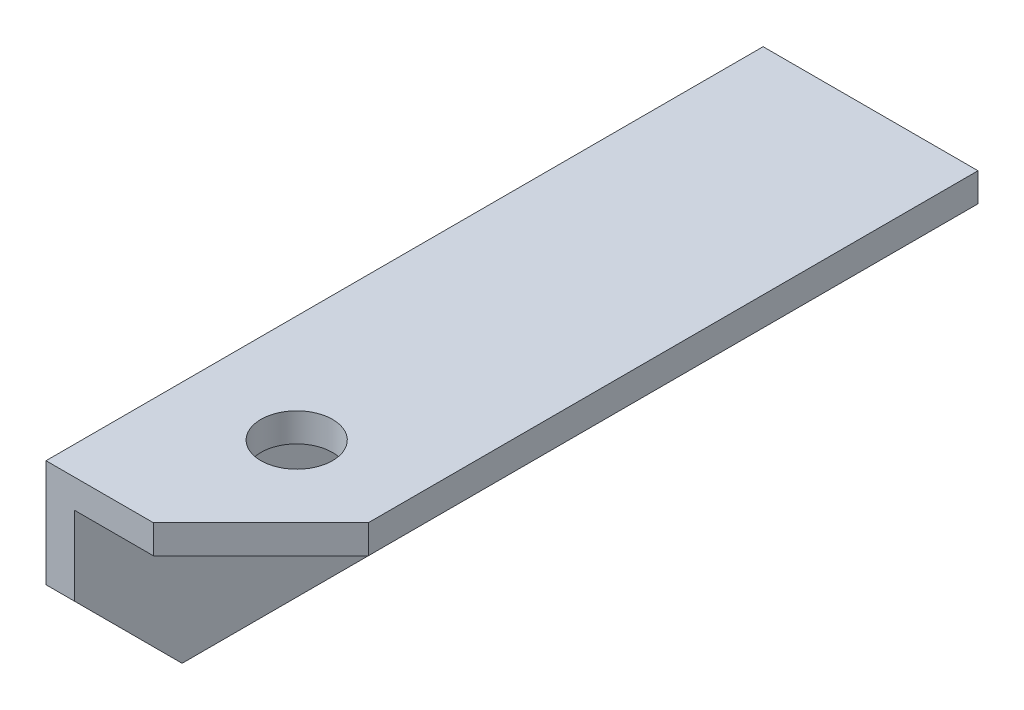
ISO-10303-21;
HEADER;
FILE_DESCRIPTION(('STEP AP214'),'2;1');
FILE_NAME('part.step','',(''),(''),'','','');
FILE_SCHEMA(('AUTOMOTIVE_DESIGN { 1 0 10303 214 1 1 1 1 }'));
ENDSEC;
DATA;
#1=APPLICATION_CONTEXT('core data for automotive mechanical design processes');
#2=APPLICATION_PROTOCOL_DEFINITION('international standard','automotive_design',2000,#1);
#3=PRODUCT_CONTEXT('',#1,'mechanical');
#4=PRODUCT('Part','Part','',(#3));
#5=PRODUCT_RELATED_PRODUCT_CATEGORY('part','',(#4));
#6=PRODUCT_DEFINITION_FORMATION('','',#4);
#7=PRODUCT_DEFINITION_CONTEXT('part definition',#1,'design');
#8=PRODUCT_DEFINITION('design','',#6,#7);
#9=PRODUCT_DEFINITION_SHAPE('','',#8);
#10=(LENGTH_UNIT() NAMED_UNIT(*) SI_UNIT(.MILLI.,.METRE.));
#11=(NAMED_UNIT(*) PLANE_ANGLE_UNIT() SI_UNIT($,.RADIAN.));
#12=(NAMED_UNIT(*) SI_UNIT($,.STERADIAN.) SOLID_ANGLE_UNIT());
#13=UNCERTAINTY_MEASURE_WITH_UNIT(LENGTH_MEASURE(1.E-05),#10,'distance_accuracy_value','');
#14=(GEOMETRIC_REPRESENTATION_CONTEXT(3) GLOBAL_UNCERTAINTY_ASSIGNED_CONTEXT((#13)) GLOBAL_UNIT_ASSIGNED_CONTEXT((#10,
#11,#12)) REPRESENTATION_CONTEXT('',''));
#15=CARTESIAN_POINT('',(0.,0.,0.));
#16=DIRECTION('',(0.,0.,1.));
#17=DIRECTION('',(1.,0.,0.));
#18=AXIS2_PLACEMENT_3D('',#15,#16,#17);
#19=CARTESIAN_POINT('',(1.75,647.65,-11.0990731963808));
#20=DIRECTION('',(0.,-1.,0.));
#21=DIRECTION('',(1.,0.,0.));
#22=AXIS2_PLACEMENT_3D('',#19,#20,#21);
#23=PLANE('',#22);
#24=CARTESIAN_POINT('',(44.9999999999998,647.65,-1.01671635384947E-13));
#25=DIRECTION('',(0.,-1.,0.));
#26=DIRECTION('',(0.,0.,-1.));
#27=AXIS2_PLACEMENT_3D('',#24,#25,#26);
#28=CIRCLE('',#27,4.99999999999999);
#29=CARTESIAN_POINT('',(44.9999999999998,647.65,-5.00000000000009));
#30=VERTEX_POINT('',#29);
#31=EDGE_CURVE('E218',#30,#30,#28,.T.);
#32=ORIENTED_EDGE('',*,*,#31,.T.);
#33=EDGE_LOOP('',(#32));
#34=FACE_BOUND('',#33,.T.);
#35=DIRECTION('',(-0.707106781186548,0.,0.707106781186547));
#36=VECTOR('',#35,1.);
#37=CARTESIAN_POINT('',(59.9999999999998,647.65,4.9999999999999));
#38=LINE('',#37,#36);
#39=CARTESIAN_POINT('',(59.9999999999998,647.65,4.99999999999991));
#40=VERTEX_POINT('',#39);
#41=CARTESIAN_POINT('',(44.9999999999998,647.65,19.9999999999999));
#42=VERTEX_POINT('',#41);
#43=EDGE_CURVE('E12',#40,#42,#38,.T.);
#44=ORIENTED_EDGE('',*,*,#43,.F.);
#45=DIRECTION('',(0.,0.,1.));
#46=VECTOR('',#45,1.);
#47=CARTESIAN_POINT('',(59.9999999999998,647.65,-80.1201360343224));
#48=LINE('',#47,#46);
#49=CARTESIAN_POINT('',(59.9999999999998,647.65,-80.1201360343224));
#50=VERTEX_POINT('',#49);
#51=EDGE_CURVE('E152',#50,#40,#48,.T.);
#52=ORIENTED_EDGE('',*,*,#51,.F.);
#53=DIRECTION('',(1.,0.,0.));
#54=VECTOR('',#53,1.);
#55=CARTESIAN_POINT('',(59.9999999999998,647.65,-80.1201360343224));
#56=LINE('',#55,#54);
#57=CARTESIAN_POINT('',(29.9999999999998,647.65,-80.1201360343224));
#58=VERTEX_POINT('',#57);
#59=EDGE_CURVE('E143',#58,#50,#56,.T.);
#60=ORIENTED_EDGE('',*,*,#59,.F.);
#61=DIRECTION('',(0.,0.,-1.));
#62=VECTOR('',#61,1.);
#63=CARTESIAN_POINT('',(29.9999999999998,647.65,-80.1201360343224));
#64=LINE('',#63,#62);
#65=CARTESIAN_POINT('',(29.9999999999998,647.65,19.9999999999999));
#66=VERTEX_POINT('',#65);
#67=EDGE_CURVE('E213',#66,#58,#64,.T.);
#68=ORIENTED_EDGE('',*,*,#67,.F.);
#69=DIRECTION('',(1.,0.,0.));
#70=VECTOR('',#69,1.);
#71=CARTESIAN_POINT('',(33.9999999999998,647.65,19.9999999999999));
#72=LINE('',#71,#70);
#73=EDGE_CURVE('E132',#66,#42,#72,.T.);
#74=ORIENTED_EDGE('',*,*,#73,.T.);
#75=EDGE_LOOP('',(#44,#52,#60,#68,#74));
#76=FACE_BOUND('',#75,.T.);
#77=ADVANCED_FACE('F38',(#34,#76),#23,.F.);
#78=CARTESIAN_POINT('',(1.75,643.65,-11.0990731963808));
#79=DIRECTION('',(0.,-1.,0.));
#80=DIRECTION('',(1.,0.,0.));
#81=AXIS2_PLACEMENT_3D('',#78,#79,#80);
#82=PLANE('',#81);
#83=CARTESIAN_POINT('',(44.9999999999998,643.65,-1.01671635384947E-13));
#84=DIRECTION('',(0.,-1.,0.));
#85=DIRECTION('',(0.,0.,-1.));
#86=AXIS2_PLACEMENT_3D('',#83,#84,#85);
#87=CIRCLE('',#86,4.99999999999999);
#88=CARTESIAN_POINT('',(44.9999999999998,643.65,-5.00000000000009));
#89=VERTEX_POINT('',#88);
#90=EDGE_CURVE('E222',#89,#89,#87,.T.);
#91=ORIENTED_EDGE('',*,*,#90,.F.);
#92=EDGE_LOOP('',(#91));
#93=FACE_BOUND('',#92,.T.);
#94=DIRECTION('',(-0.707106781186548,0.,0.707106781186547));
#95=VECTOR('',#94,1.);
#96=CARTESIAN_POINT('',(59.9999999999998,643.65,4.9999999999999));
#97=LINE('',#96,#95);
#98=CARTESIAN_POINT('',(59.9999999999998,643.65,4.99999999999991));
#99=VERTEX_POINT('',#98);
#100=CARTESIAN_POINT('',(44.9999999999998,643.65,19.9999999999999));
#101=VERTEX_POINT('',#100);
#102=EDGE_CURVE('E179',#99,#101,#97,.T.);
#103=ORIENTED_EDGE('',*,*,#102,.T.);
#104=DIRECTION('',(1.,0.,0.));
#105=VECTOR('',#104,1.);
#106=CARTESIAN_POINT('',(33.9999999999998,643.65,19.9999999999999));
#107=LINE('',#106,#105);
#108=CARTESIAN_POINT('',(33.9999999999998,643.65,19.9999999999999));
#109=VERTEX_POINT('',#108);
#110=EDGE_CURVE('E140',#109,#101,#107,.T.);
#111=ORIENTED_EDGE('',*,*,#110,.F.);
#112=DIRECTION('',(0.,0.,1.));
#113=VECTOR('',#112,1.);
#114=CARTESIAN_POINT('',(33.9999999999998,643.65,19.9999999999999));
#115=LINE('',#114,#113);
#116=CARTESIAN_POINT('',(33.9999999999998,643.65,-80.1201360343224));
#117=VERTEX_POINT('',#116);
#118=EDGE_CURVE('E129',#117,#109,#115,.T.);
#119=ORIENTED_EDGE('',*,*,#118,.F.);
#120=DIRECTION('',(-1.,0.,0.));
#121=VECTOR('',#120,1.);
#122=CARTESIAN_POINT('',(44.9999999999998,643.65,-80.1201360343224));
#123=LINE('',#122,#121);
#124=CARTESIAN_POINT('',(59.9999999999998,643.65,-80.1201360343224));
#125=VERTEX_POINT('',#124);
#126=EDGE_CURVE('E147',#125,#117,#123,.T.);
#127=ORIENTED_EDGE('',*,*,#126,.F.);
#128=DIRECTION('',(0.,0.,1.));
#129=VECTOR('',#128,1.);
#130=CARTESIAN_POINT('',(59.9999999999998,643.65,-80.1201360343224));
#131=LINE('',#130,#129);
#132=EDGE_CURVE('E149',#125,#99,#131,.T.);
#133=ORIENTED_EDGE('',*,*,#132,.T.);
#134=EDGE_LOOP('',(#103,#111,#119,#127,#133));
#135=FACE_BOUND('',#134,.T.);
#136=ADVANCED_FACE('F195',(#93,#135),#82,.T.);
#137=CARTESIAN_POINT('',(52.4999999999998,647.65,12.4999999999999));
#138=DIRECTION('',(0.707106781186547,0.,0.707106781186548));
#139=DIRECTION('',(0.707106781186548,0.,-0.707106781186547));
#140=AXIS2_PLACEMENT_3D('',#137,#138,#139);
#141=PLANE('',#140);
#142=ORIENTED_EDGE('',*,*,#43,.T.);
#143=DIRECTION('',(0.,-1.,0.));
#144=VECTOR('',#143,1.);
#145=CARTESIAN_POINT('',(44.9999999999998,647.65,19.9999999999999));
#146=LINE('',#145,#144);
#147=EDGE_CURVE('E48',#101,#42,#146,.F.);
#148=ORIENTED_EDGE('',*,*,#147,.F.);
#149=ORIENTED_EDGE('',*,*,#102,.F.);
#150=DIRECTION('',(0.,1.,0.));
#151=VECTOR('',#150,1.);
#152=CARTESIAN_POINT('',(59.9999999999998,647.65,4.9999999999999));
#153=LINE('',#152,#151);
#154=EDGE_CURVE('E42',#40,#99,#153,.F.);
#155=ORIENTED_EDGE('',*,*,#154,.F.);
#156=EDGE_LOOP('',(#142,#148,#149,#155));
#157=FACE_BOUND('',#156,.T.);
#158=ADVANCED_FACE('F40',(#157),#141,.T.);
#159=CARTESIAN_POINT('',(59.9999999999998,643.65,-80.1201360343224));
#160=DIRECTION('',(-1.,0.,0.));
#161=DIRECTION('',(0.,0.,1.));
#162=AXIS2_PLACEMENT_3D('',#159,#160,#161);
#163=PLANE('',#162);
#164=ORIENTED_EDGE('',*,*,#154,.T.);
#165=ORIENTED_EDGE('',*,*,#132,.F.);
#166=DIRECTION('',(0.,-1.,0.));
#167=VECTOR('',#166,1.);
#168=CARTESIAN_POINT('',(59.9999999999998,643.65,-80.1201360343224));
#169=LINE('',#168,#167);
#170=EDGE_CURVE('E145',#50,#125,#169,.T.);
#171=ORIENTED_EDGE('',*,*,#170,.F.);
#172=ORIENTED_EDGE('',*,*,#51,.T.);
#173=EDGE_LOOP('',(#164,#165,#171,#172));
#174=FACE_BOUND('',#173,.T.);
#175=ADVANCED_FACE('F191',(#174),#163,.F.);
#176=CARTESIAN_POINT('',(0.,0.,-80.1201360343224));
#177=DIRECTION('',(0.,0.,1.));
#178=DIRECTION('',(1.,0.,0.));
#179=AXIS2_PLACEMENT_3D('',#176,#177,#178);
#180=PLANE('',#179);
#181=ORIENTED_EDGE('',*,*,#126,.T.);
#182=DIRECTION('',(0.,-1.,0.));
#183=VECTOR('',#182,1.);
#184=CARTESIAN_POINT('',(33.9999999999998,617.65,-80.1201360343224));
#185=LINE('',#184,#183);
#186=CARTESIAN_POINT('',(33.9999999999998,617.65,-80.1201360343224));
#187=VERTEX_POINT('',#186);
#188=EDGE_CURVE('E124',#117,#187,#185,.T.);
#189=ORIENTED_EDGE('',*,*,#188,.T.);
#190=DIRECTION('',(1.,0.,0.));
#191=VECTOR('',#190,1.);
#192=CARTESIAN_POINT('',(29.9999999999998,617.65,-80.1201360343224));
#193=LINE('',#192,#191);
#194=CARTESIAN_POINT('',(29.9999999999998,617.65,-80.1201360343224));
#195=VERTEX_POINT('',#194);
#196=EDGE_CURVE('E134',#195,#187,#193,.T.);
#197=ORIENTED_EDGE('',*,*,#196,.F.);
#198=DIRECTION('',(0.,-1.,0.));
#199=VECTOR('',#198,1.);
#200=CARTESIAN_POINT('',(29.9999999999998,617.65,-80.1201360343224));
#201=LINE('',#200,#199);
#202=EDGE_CURVE('E120',#58,#195,#201,.T.);
#203=ORIENTED_EDGE('',*,*,#202,.F.);
#204=ORIENTED_EDGE('',*,*,#59,.T.);
#205=ORIENTED_EDGE('',*,*,#170,.T.);
#206=EDGE_LOOP('',(#181,#189,#197,#203,#204,#205));
#207=FACE_BOUND('',#206,.T.);
#208=ADVANCED_FACE('F199',(#207),#180,.F.);
#209=CARTESIAN_POINT('',(33.9999999999998,647.65,19.9999999999999));
#210=DIRECTION('',(0.,0.,-1.));
#211=DIRECTION('',(-1.,0.,0.));
#212=AXIS2_PLACEMENT_3D('',#209,#210,#211);
#213=PLANE('',#212);
#214=ORIENTED_EDGE('',*,*,#147,.T.);
#215=ORIENTED_EDGE('',*,*,#73,.F.);
#216=DIRECTION('',(0.,1.,0.));
#217=VECTOR('',#216,1.);
#218=CARTESIAN_POINT('',(29.9999999999998,647.65,19.9999999999999));
#219=LINE('',#218,#217);
#220=CARTESIAN_POINT('',(29.9999999999998,632.65,19.9999999999999));
#221=VERTEX_POINT('',#220);
#222=EDGE_CURVE('E113',#221,#66,#219,.T.);
#223=ORIENTED_EDGE('',*,*,#222,.F.);
#224=DIRECTION('',(1.,0.,0.));
#225=VECTOR('',#224,1.);
#226=CARTESIAN_POINT('',(29.9999999999998,632.65,19.9999999999999));
#227=LINE('',#226,#225);
#228=CARTESIAN_POINT('',(33.9999999999998,632.65,19.9999999999999));
#229=VERTEX_POINT('',#228);
#230=EDGE_CURVE('E109',#221,#229,#227,.T.);
#231=ORIENTED_EDGE('',*,*,#230,.T.);
#232=DIRECTION('',(0.,1.,0.));
#233=VECTOR('',#232,1.);
#234=CARTESIAN_POINT('',(33.9999999999998,647.65,19.9999999999999));
#235=LINE('',#234,#233);
#236=EDGE_CURVE('E206',#229,#109,#235,.T.);
#237=ORIENTED_EDGE('',*,*,#236,.T.);
#238=ORIENTED_EDGE('',*,*,#110,.T.);
#239=EDGE_LOOP('',(#214,#215,#223,#231,#237,#238));
#240=FACE_BOUND('',#239,.T.);
#241=ADVANCED_FACE('F203',(#240),#213,.F.);
#242=CARTESIAN_POINT('',(29.9999999999998,617.65,4.99999999999993));
#243=DIRECTION('',(0.,1.,0.));
#244=DIRECTION('',(0.,0.,1.));
#245=AXIS2_PLACEMENT_3D('',#242,#243,#244);
#246=PLANE('',#245);
#247=DIRECTION('',(0.,0.,1.));
#248=VECTOR('',#247,1.);
#249=CARTESIAN_POINT('',(33.9999999999998,617.65,4.99999999999993));
#250=LINE('',#249,#248);
#251=CARTESIAN_POINT('',(33.9999999999998,617.65,4.99999999999993));
#252=VERTEX_POINT('',#251);
#253=EDGE_CURVE('E128',#187,#252,#250,.T.);
#254=ORIENTED_EDGE('',*,*,#253,.T.);
#255=DIRECTION('',(1.,0.,0.));
#256=VECTOR('',#255,1.);
#257=CARTESIAN_POINT('',(29.9999999999998,617.65,4.99999999999993));
#258=LINE('',#257,#256);
#259=CARTESIAN_POINT('',(29.9999999999998,617.65,4.99999999999993));
#260=VERTEX_POINT('',#259);
#261=EDGE_CURVE('E106',#260,#252,#258,.T.);
#262=ORIENTED_EDGE('',*,*,#261,.F.);
#263=DIRECTION('',(0.,0.,1.));
#264=VECTOR('',#263,1.);
#265=CARTESIAN_POINT('',(29.9999999999998,617.65,4.99999999999993));
#266=LINE('',#265,#264);
#267=EDGE_CURVE('E114',#195,#260,#266,.T.);
#268=ORIENTED_EDGE('',*,*,#267,.F.);
#269=ORIENTED_EDGE('',*,*,#196,.T.);
#270=EDGE_LOOP('',(#254,#262,#268,#269));
#271=FACE_BOUND('',#270,.T.);
#272=ADVANCED_FACE('F126',(#271),#246,.F.);
#273=CARTESIAN_POINT('',(29.9999999999998,632.65,19.9999999999999));
#274=DIRECTION('',(0.,0.707106781186547,-0.707106781186548));
#275=DIRECTION('',(0.,0.707106781186548,0.707106781186547));
#276=AXIS2_PLACEMENT_3D('',#273,#274,#275);
#277=PLANE('',#276);
#278=DIRECTION('',(0.,0.707106781186548,0.707106781186547));
#279=VECTOR('',#278,1.);
#280=CARTESIAN_POINT('',(33.9999999999998,632.65,19.9999999999999));
#281=LINE('',#280,#279);
#282=EDGE_CURVE('E210',#252,#229,#281,.T.);
#283=ORIENTED_EDGE('',*,*,#282,.T.);
#284=ORIENTED_EDGE('',*,*,#230,.F.);
#285=DIRECTION('',(0.,0.707106781186548,0.707106781186547));
#286=VECTOR('',#285,1.);
#287=CARTESIAN_POINT('',(29.9999999999998,632.65,19.9999999999999));
#288=LINE('',#287,#286);
#289=EDGE_CURVE('E102',#260,#221,#288,.T.);
#290=ORIENTED_EDGE('',*,*,#289,.F.);
#291=ORIENTED_EDGE('',*,*,#261,.T.);
#292=EDGE_LOOP('',(#283,#284,#290,#291));
#293=FACE_BOUND('',#292,.T.);
#294=ADVANCED_FACE('F104',(#293),#277,.F.);
#295=CARTESIAN_POINT('',(29.9999999999998,0.,0.));
#296=DIRECTION('',(1.,0.,0.));
#297=DIRECTION('',(0.,0.,-1.));
#298=AXIS2_PLACEMENT_3D('',#295,#296,#297);
#299=PLANE('',#298);
#300=ORIENTED_EDGE('',*,*,#267,.T.);
#301=ORIENTED_EDGE('',*,*,#289,.T.);
#302=ORIENTED_EDGE('',*,*,#222,.T.);
#303=ORIENTED_EDGE('',*,*,#67,.T.);
#304=ORIENTED_EDGE('',*,*,#202,.T.);
#305=EDGE_LOOP('',(#300,#301,#302,#303,#304));
#306=FACE_BOUND('',#305,.T.);
#307=ADVANCED_FACE('F117',(#306),#299,.F.);
#308=CARTESIAN_POINT('',(33.9999999999998,0.,0.));
#309=DIRECTION('',(1.,0.,0.));
#310=DIRECTION('',(0.,0.,-1.));
#311=AXIS2_PLACEMENT_3D('',#308,#309,#310);
#312=PLANE('',#311);
#313=ORIENTED_EDGE('',*,*,#188,.F.);
#314=ORIENTED_EDGE('',*,*,#118,.T.);
#315=ORIENTED_EDGE('',*,*,#236,.F.);
#316=ORIENTED_EDGE('',*,*,#282,.F.);
#317=ORIENTED_EDGE('',*,*,#253,.F.);
#318=EDGE_LOOP('',(#313,#314,#315,#316,#317));
#319=FACE_BOUND('',#318,.T.);
#320=ADVANCED_FACE('F208',(#319),#312,.T.);
#321=CARTESIAN_POINT('',(44.9999999999998,643.65,-1.01671635384947E-13));
#322=DIRECTION('',(0.,-1.,0.));
#323=DIRECTION('',(0.,0.,-1.));
#324=AXIS2_PLACEMENT_3D('',#321,#322,#323);
#325=CYLINDRICAL_SURFACE('',#324,4.99999999999999);
#326=ORIENTED_EDGE('',*,*,#31,.F.);
#327=EDGE_LOOP('',(#326));
#328=FACE_BOUND('',#327,.T.);
#329=ORIENTED_EDGE('',*,*,#90,.T.);
#330=EDGE_LOOP('',(#329));
#331=FACE_BOUND('',#330,.T.);
#332=ADVANCED_FACE('F226',(#328,#331),#325,.F.);
#333=CLOSED_SHELL('',(#77,#136,#158,#175,#208,#241,#272,#294,#307,#320,#332));
#334=MANIFOLD_SOLID_BREP('B2',#333);
#335=ADVANCED_BREP_SHAPE_REPRESENTATION('',(#18,#334),#14);
#336=SHAPE_DEFINITION_REPRESENTATION(#9,#335);
ENDSEC;
END-ISO-10303-21;
